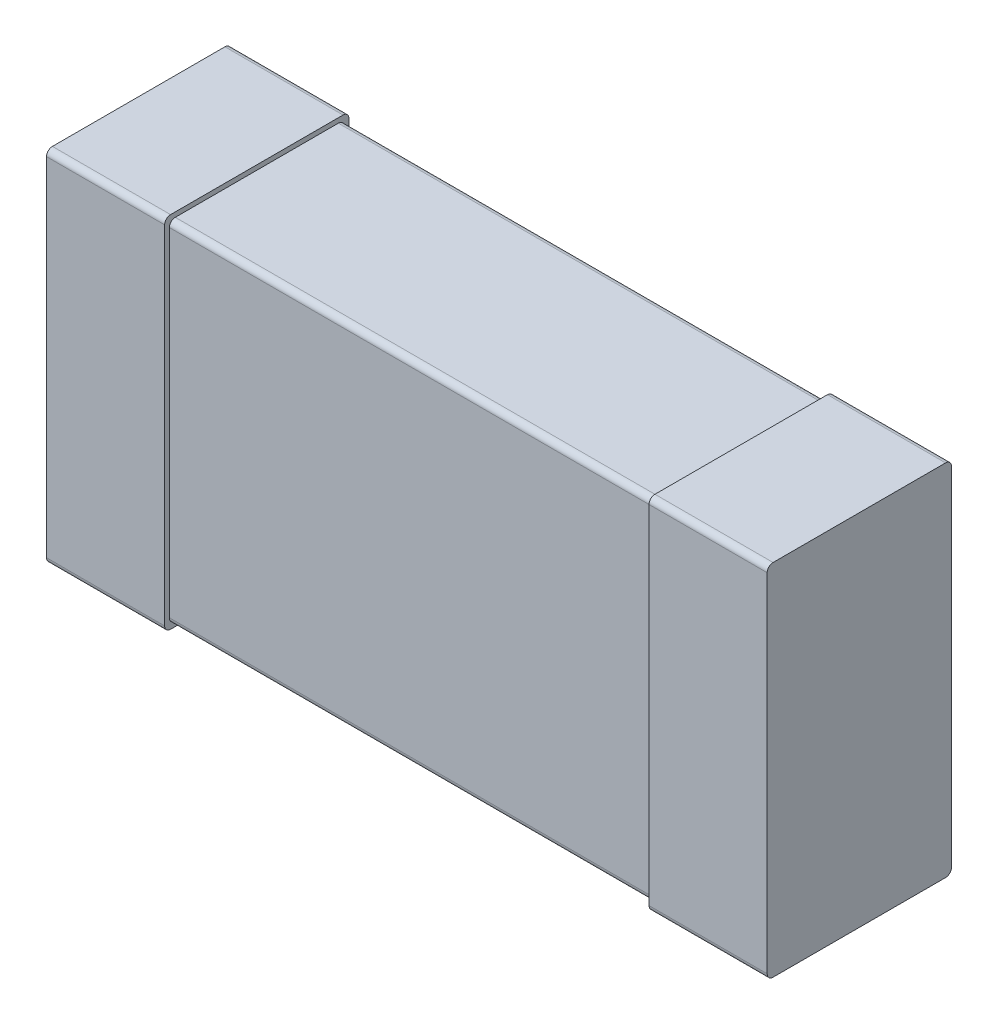
ISO-10303-21;
HEADER;
FILE_DESCRIPTION(('STEP AP214'),'2;1');
FILE_NAME('part.step','',(''),(''),'','','');
FILE_SCHEMA(('AUTOMOTIVE_DESIGN { 1 0 10303 214 1 1 1 1 }'));
ENDSEC;
DATA;
#1=APPLICATION_CONTEXT('core data for automotive mechanical design processes');
#2=APPLICATION_PROTOCOL_DEFINITION('international standard','automotive_design',2000,#1);
#3=PRODUCT_CONTEXT('',#1,'mechanical');
#4=PRODUCT('Part','Part','',(#3));
#5=PRODUCT_RELATED_PRODUCT_CATEGORY('part','',(#4));
#6=PRODUCT_DEFINITION_FORMATION('','',#4);
#7=PRODUCT_DEFINITION_CONTEXT('part definition',#1,'design');
#8=PRODUCT_DEFINITION('design','',#6,#7);
#9=PRODUCT_DEFINITION_SHAPE('','',#8);
#10=(LENGTH_UNIT() NAMED_UNIT(*) SI_UNIT(.MILLI.,.METRE.));
#11=(NAMED_UNIT(*) PLANE_ANGLE_UNIT() SI_UNIT($,.RADIAN.));
#12=(NAMED_UNIT(*) SI_UNIT($,.STERADIAN.) SOLID_ANGLE_UNIT());
#13=UNCERTAINTY_MEASURE_WITH_UNIT(LENGTH_MEASURE(1.E-05),#10,'distance_accuracy_value','');
#14=(GEOMETRIC_REPRESENTATION_CONTEXT(3) GLOBAL_UNCERTAINTY_ASSIGNED_CONTEXT((#13)) GLOBAL_UNIT_ASSIGNED_CONTEXT((#10,
#11,#12)) REPRESENTATION_CONTEXT('',''));
#15=CARTESIAN_POINT('',(0.,0.,0.));
#16=DIRECTION('',(0.,0.,1.));
#17=DIRECTION('',(1.,0.,0.));
#18=AXIS2_PLACEMENT_3D('',#15,#16,#17);
#19=CARTESIAN_POINT('',(-1.025,-0.74,0.76));
#20=DIRECTION('',(0.,0.,1.));
#21=DIRECTION('',(1.,0.,0.));
#22=AXIS2_PLACEMENT_3D('',#19,#20,#21);
#23=PLANE('',#22);
#24=DIRECTION('',(0.,1.,0.));
#25=VECTOR('',#24,1.);
#26=CARTESIAN_POINT('',(1.025,-0.74,0.76));
#27=LINE('',#26,#25);
#28=CARTESIAN_POINT('',(1.025,-0.715,0.76));
#29=VERTEX_POINT('',#28);
#30=CARTESIAN_POINT('',(1.025,0.715,0.76));
#31=VERTEX_POINT('',#30);
#32=EDGE_CURVE('E182',#29,#31,#27,.T.);
#33=ORIENTED_EDGE('',*,*,#32,.T.);
#34=DIRECTION('',(1.,0.,0.));
#35=VECTOR('',#34,1.);
#36=CARTESIAN_POINT('',(-1.025,0.715,0.76));
#37=LINE('',#36,#35);
#38=CARTESIAN_POINT('',(-1.025,0.715,0.76));
#39=VERTEX_POINT('',#38);
#40=EDGE_CURVE('E245',#39,#31,#37,.T.);
#41=ORIENTED_EDGE('',*,*,#40,.F.);
#42=DIRECTION('',(0.,1.,0.));
#43=VECTOR('',#42,1.);
#44=CARTESIAN_POINT('',(-1.025,-0.74,0.76));
#45=LINE('',#44,#43);
#46=CARTESIAN_POINT('',(-1.025,-0.715,0.76));
#47=VERTEX_POINT('',#46);
#48=EDGE_CURVE('E250',#39,#47,#45,.F.);
#49=ORIENTED_EDGE('',*,*,#48,.T.);
#50=DIRECTION('',(1.,0.,0.));
#51=VECTOR('',#50,1.);
#52=CARTESIAN_POINT('',(-1.025,-0.715,0.76));
#53=LINE('',#52,#51);
#54=EDGE_CURVE('E252',#29,#47,#53,.F.);
#55=ORIENTED_EDGE('',*,*,#54,.F.);
#56=EDGE_LOOP('',(#33,#41,#49,#55));
#57=FACE_BOUND('',#56,.T.);
#58=ADVANCED_FACE('F16',(#57),#23,.T.);
#59=CARTESIAN_POINT('',(-1.525,-0.76,0.));
#60=DIRECTION('',(1.,0.,0.));
#61=DIRECTION('',(0.,0.,-1.));
#62=AXIS2_PLACEMENT_3D('',#59,#60,#61);
#63=PLANE('',#62);
#64=DIRECTION('',(0.,1.,0.));
#65=VECTOR('',#64,1.);
#66=CARTESIAN_POINT('',(-1.525,-0.76,0.78));
#67=LINE('',#66,#65);
#68=CARTESIAN_POINT('',(-1.525,0.735,0.78));
#69=VERTEX_POINT('',#68);
#70=CARTESIAN_POINT('',(-1.525,-0.735,0.78));
#71=VERTEX_POINT('',#70);
#72=EDGE_CURVE('E201',#69,#71,#67,.F.);
#73=ORIENTED_EDGE('',*,*,#72,.F.);
#74=CARTESIAN_POINT('',(-1.525,0.735,0.755));
#75=DIRECTION('',(1.,0.,0.));
#76=DIRECTION('',(0.,0.,-1.));
#77=AXIS2_PLACEMENT_3D('',#74,#75,#76);
#78=CIRCLE('',#77,0.025);
#79=CARTESIAN_POINT('',(-1.525,0.76,0.755));
#80=VERTEX_POINT('',#79);
#81=EDGE_CURVE('E210',#80,#69,#78,.T.);
#82=ORIENTED_EDGE('',*,*,#81,.F.);
#83=DIRECTION('',(0.,0.,1.));
#84=VECTOR('',#83,1.);
#85=CARTESIAN_POINT('',(-1.525,0.76,0.));
#86=LINE('',#85,#84);
#87=CARTESIAN_POINT('',(-1.525,0.76,0.025));
#88=VERTEX_POINT('',#87);
#89=EDGE_CURVE('E214',#88,#80,#86,.T.);
#90=ORIENTED_EDGE('',*,*,#89,.F.);
#91=CARTESIAN_POINT('',(-1.525,0.735,0.025));
#92=DIRECTION('',(1.,0.,0.));
#93=DIRECTION('',(0.,0.,-1.));
#94=AXIS2_PLACEMENT_3D('',#91,#92,#93);
#95=CIRCLE('',#94,0.025);
#96=CARTESIAN_POINT('',(-1.525,0.735,0.));
#97=VERTEX_POINT('',#96);
#98=EDGE_CURVE('E215',#97,#88,#95,.T.);
#99=ORIENTED_EDGE('',*,*,#98,.F.);
#100=DIRECTION('',(0.,1.,0.));
#101=VECTOR('',#100,1.);
#102=CARTESIAN_POINT('',(-1.525,-0.76,0.));
#103=LINE('',#102,#101);
#104=CARTESIAN_POINT('',(-1.525,-0.735,0.));
#105=VERTEX_POINT('',#104);
#106=EDGE_CURVE('E222',#97,#105,#103,.F.);
#107=ORIENTED_EDGE('',*,*,#106,.T.);
#108=CARTESIAN_POINT('',(-1.525,-0.735,0.025));
#109=DIRECTION('',(1.,0.,0.));
#110=DIRECTION('',(0.,0.,-1.));
#111=AXIS2_PLACEMENT_3D('',#108,#109,#110);
#112=CIRCLE('',#111,0.025);
#113=CARTESIAN_POINT('',(-1.525,-0.76,0.025));
#114=VERTEX_POINT('',#113);
#115=EDGE_CURVE('E187',#114,#105,#112,.T.);
#116=ORIENTED_EDGE('',*,*,#115,.F.);
#117=DIRECTION('',(0.,0.,1.));
#118=VECTOR('',#117,1.);
#119=CARTESIAN_POINT('',(-1.525,-0.76,0.));
#120=LINE('',#119,#118);
#121=CARTESIAN_POINT('',(-1.525,-0.76,0.755));
#122=VERTEX_POINT('',#121);
#123=EDGE_CURVE('E184',#114,#122,#120,.T.);
#124=ORIENTED_EDGE('',*,*,#123,.T.);
#125=CARTESIAN_POINT('',(-1.525,-0.735,0.755));
#126=DIRECTION('',(1.,0.,0.));
#127=DIRECTION('',(0.,0.,-1.));
#128=AXIS2_PLACEMENT_3D('',#125,#126,#127);
#129=CIRCLE('',#128,0.025);
#130=EDGE_CURVE('E19',#71,#122,#129,.T.);
#131=ORIENTED_EDGE('',*,*,#130,.F.);
#132=EDGE_LOOP('',(#73,#82,#90,#99,#107,#116,#124,#131));
#133=FACE_BOUND('',#132,.T.);
#134=ADVANCED_FACE('F185',(#133),#63,.F.);
#135=CARTESIAN_POINT('',(-1.025,-0.715,0.735));
#136=DIRECTION('',(1.,0.,0.));
#137=DIRECTION('',(0.,0.,-1.));
#138=AXIS2_PLACEMENT_3D('',#135,#136,#137);
#139=CYLINDRICAL_SURFACE('',#138,0.025);
#140=ORIENTED_EDGE('',*,*,#54,.T.);
#141=CARTESIAN_POINT('',(-1.025,-0.715,0.735));
#142=DIRECTION('',(1.,0.,0.));
#143=DIRECTION('',(0.,0.,-1.));
#144=AXIS2_PLACEMENT_3D('',#141,#142,#143);
#145=CIRCLE('',#144,0.025);
#146=CARTESIAN_POINT('',(-1.025,-0.74,0.735));
#147=VERTEX_POINT('',#146);
#148=EDGE_CURVE('E255',#47,#147,#145,.T.);
#149=ORIENTED_EDGE('',*,*,#148,.T.);
#150=DIRECTION('',(1.,0.,0.));
#151=VECTOR('',#150,1.);
#152=CARTESIAN_POINT('',(-1.025,-0.74,0.735));
#153=LINE('',#152,#151);
#154=CARTESIAN_POINT('',(1.025,-0.74,0.735));
#155=VERTEX_POINT('',#154);
#156=EDGE_CURVE('E204',#147,#155,#153,.T.);
#157=ORIENTED_EDGE('',*,*,#156,.T.);
#158=CARTESIAN_POINT('',(1.025,-0.715,0.735));
#159=DIRECTION('',(1.,0.,0.));
#160=DIRECTION('',(0.,0.,-1.));
#161=AXIS2_PLACEMENT_3D('',#158,#159,#160);
#162=CIRCLE('',#161,0.025);
#163=EDGE_CURVE('E181',#155,#29,#162,.F.);
#164=ORIENTED_EDGE('',*,*,#163,.T.);
#165=EDGE_LOOP('',(#140,#149,#157,#164));
#166=FACE_BOUND('',#165,.T.);
#167=ADVANCED_FACE('F314',(#166),#139,.T.);
#168=CARTESIAN_POINT('',(1.525,-0.76,0.));
#169=DIRECTION('',(1.,0.,0.));
#170=DIRECTION('',(0.,0.,-1.));
#171=AXIS2_PLACEMENT_3D('',#168,#169,#170);
#172=PLANE('',#171);
#173=DIRECTION('',(0.,1.,0.));
#174=VECTOR('',#173,1.);
#175=CARTESIAN_POINT('',(1.525,-0.76,0.78));
#176=LINE('',#175,#174);
#177=CARTESIAN_POINT('',(1.525,-0.735,0.78));
#178=VERTEX_POINT('',#177);
#179=CARTESIAN_POINT('',(1.525,0.735,0.78));
#180=VERTEX_POINT('',#179);
#181=EDGE_CURVE('E225',#178,#180,#176,.T.);
#182=ORIENTED_EDGE('',*,*,#181,.F.);
#183=CARTESIAN_POINT('',(1.525,-0.735,0.755));
#184=DIRECTION('',(1.,0.,0.));
#185=DIRECTION('',(0.,0.,-1.));
#186=AXIS2_PLACEMENT_3D('',#183,#184,#185);
#187=CIRCLE('',#186,0.025);
#188=CARTESIAN_POINT('',(1.525,-0.76,0.755));
#189=VERTEX_POINT('',#188);
#190=EDGE_CURVE('E308',#178,#189,#187,.T.);
#191=ORIENTED_EDGE('',*,*,#190,.T.);
#192=DIRECTION('',(0.,0.,1.));
#193=VECTOR('',#192,1.);
#194=CARTESIAN_POINT('',(1.525,-0.76,0.));
#195=LINE('',#194,#193);
#196=CARTESIAN_POINT('',(1.525,-0.76,0.025));
#197=VERTEX_POINT('',#196);
#198=EDGE_CURVE('E229',#189,#197,#195,.F.);
#199=ORIENTED_EDGE('',*,*,#198,.T.);
#200=CARTESIAN_POINT('',(1.525,-0.735,0.025));
#201=DIRECTION('',(1.,0.,0.));
#202=DIRECTION('',(0.,0.,-1.));
#203=AXIS2_PLACEMENT_3D('',#200,#201,#202);
#204=CIRCLE('',#203,0.025);
#205=CARTESIAN_POINT('',(1.525,-0.735,0.));
#206=VERTEX_POINT('',#205);
#207=EDGE_CURVE('E232',#206,#197,#204,.F.);
#208=ORIENTED_EDGE('',*,*,#207,.F.);
#209=DIRECTION('',(0.,1.,0.));
#210=VECTOR('',#209,1.);
#211=CARTESIAN_POINT('',(1.525,-0.76,0.));
#212=LINE('',#211,#210);
#213=CARTESIAN_POINT('',(1.525,0.735,0.));
#214=VERTEX_POINT('',#213);
#215=EDGE_CURVE('E237',#206,#214,#212,.T.);
#216=ORIENTED_EDGE('',*,*,#215,.T.);
#217=CARTESIAN_POINT('',(1.525,0.735,0.025));
#218=DIRECTION('',(1.,0.,0.));
#219=DIRECTION('',(0.,0.,-1.));
#220=AXIS2_PLACEMENT_3D('',#217,#218,#219);
#221=CIRCLE('',#220,0.025);
#222=CARTESIAN_POINT('',(1.525,0.76,0.025));
#223=VERTEX_POINT('',#222);
#224=EDGE_CURVE('E240',#223,#214,#221,.F.);
#225=ORIENTED_EDGE('',*,*,#224,.F.);
#226=DIRECTION('',(0.,0.,1.));
#227=VECTOR('',#226,1.);
#228=CARTESIAN_POINT('',(1.525,0.76,0.));
#229=LINE('',#228,#227);
#230=CARTESIAN_POINT('',(1.525,0.76,0.755));
#231=VERTEX_POINT('',#230);
#232=EDGE_CURVE('E233',#231,#223,#229,.F.);
#233=ORIENTED_EDGE('',*,*,#232,.F.);
#234=CARTESIAN_POINT('',(1.525,0.735,0.755));
#235=DIRECTION('',(1.,0.,0.));
#236=DIRECTION('',(0.,0.,-1.));
#237=AXIS2_PLACEMENT_3D('',#234,#235,#236);
#238=CIRCLE('',#237,0.025);
#239=EDGE_CURVE('E298',#180,#231,#238,.F.);
#240=ORIENTED_EDGE('',*,*,#239,.F.);
#241=EDGE_LOOP('',(#182,#191,#199,#208,#216,#225,#233,#240));
#242=FACE_BOUND('',#241,.T.);
#243=ADVANCED_FACE('F472',(#242),#172,.T.);
#244=CARTESIAN_POINT('',(-1.025,0.715,0.735));
#245=DIRECTION('',(1.,0.,0.));
#246=DIRECTION('',(0.,0.,-1.));
#247=AXIS2_PLACEMENT_3D('',#244,#245,#246);
#248=CYLINDRICAL_SURFACE('',#247,0.025);
#249=CARTESIAN_POINT('',(1.025,0.715,0.735));
#250=DIRECTION('',(1.,0.,0.));
#251=DIRECTION('',(0.,0.,-1.));
#252=AXIS2_PLACEMENT_3D('',#249,#250,#251);
#253=CIRCLE('',#252,0.025);
#254=CARTESIAN_POINT('',(1.025,0.74,0.735));
#255=VERTEX_POINT('',#254);
#256=EDGE_CURVE('E191',#31,#255,#253,.F.);
#257=ORIENTED_EDGE('',*,*,#256,.T.);
#258=DIRECTION('',(1.,0.,0.));
#259=VECTOR('',#258,1.);
#260=CARTESIAN_POINT('',(-1.025,0.74,0.735));
#261=LINE('',#260,#259);
#262=CARTESIAN_POINT('',(-1.025,0.74,0.735));
#263=VERTEX_POINT('',#262);
#264=EDGE_CURVE('E351',#263,#255,#261,.T.);
#265=ORIENTED_EDGE('',*,*,#264,.F.);
#266=CARTESIAN_POINT('',(-1.025,0.715,0.735));
#267=DIRECTION('',(1.,0.,0.));
#268=DIRECTION('',(0.,0.,-1.));
#269=AXIS2_PLACEMENT_3D('',#266,#267,#268);
#270=CIRCLE('',#269,0.025);
#271=EDGE_CURVE('E248',#263,#39,#270,.T.);
#272=ORIENTED_EDGE('',*,*,#271,.T.);
#273=ORIENTED_EDGE('',*,*,#40,.T.);
#274=EDGE_LOOP('',(#257,#265,#272,#273));
#275=FACE_BOUND('',#274,.T.);
#276=ADVANCED_FACE('F469',(#275),#248,.T.);
#277=CARTESIAN_POINT('',(-1.525,-0.76,0.));
#278=DIRECTION('',(0.,1.,0.));
#279=DIRECTION('',(0.,0.,1.));
#280=AXIS2_PLACEMENT_3D('',#277,#278,#279);
#281=PLANE('',#280);
#282=ORIENTED_EDGE('',*,*,#123,.F.);
#283=DIRECTION('',(1.,0.,0.));
#284=VECTOR('',#283,1.);
#285=CARTESIAN_POINT('',(-1.525,-0.76,0.025));
#286=LINE('',#285,#284);
#287=CARTESIAN_POINT('',(-1.025,-0.76,0.025));
#288=VERTEX_POINT('',#287);
#289=EDGE_CURVE('E223',#288,#114,#286,.F.);
#290=ORIENTED_EDGE('',*,*,#289,.F.);
#291=DIRECTION('',(0.,0.,-1.));
#292=VECTOR('',#291,1.);
#293=CARTESIAN_POINT('',(-1.025,-0.76,0.));
#294=LINE('',#293,#292);
#295=CARTESIAN_POINT('',(-1.025,-0.76,0.755));
#296=VERTEX_POINT('',#295);
#297=EDGE_CURVE('E195',#296,#288,#294,.T.);
#298=ORIENTED_EDGE('',*,*,#297,.F.);
#299=DIRECTION('',(1.,0.,0.));
#300=VECTOR('',#299,1.);
#301=CARTESIAN_POINT('',(-1.525,-0.76,0.755));
#302=LINE('',#301,#300);
#303=EDGE_CURVE('E177',#122,#296,#302,.T.);
#304=ORIENTED_EDGE('',*,*,#303,.F.);
#305=EDGE_LOOP('',(#282,#290,#298,#304));
#306=FACE_BOUND('',#305,.T.);
#307=ADVANCED_FACE('F194',(#306),#281,.F.);
#308=CARTESIAN_POINT('',(-1.525,-0.735,0.025));
#309=DIRECTION('',(1.,0.,0.));
#310=DIRECTION('',(0.,0.,-1.));
#311=AXIS2_PLACEMENT_3D('',#308,#309,#310);
#312=CYLINDRICAL_SURFACE('',#311,0.025);
#313=CARTESIAN_POINT('',(-1.025,-0.735,0.025));
#314=DIRECTION('',(1.,0.,0.));
#315=DIRECTION('',(0.,0.,-1.));
#316=AXIS2_PLACEMENT_3D('',#313,#314,#315);
#317=CIRCLE('',#316,0.025);
#318=CARTESIAN_POINT('',(-1.025,-0.735,0.));
#319=VERTEX_POINT('',#318);
#320=EDGE_CURVE('E296',#288,#319,#317,.T.);
#321=ORIENTED_EDGE('',*,*,#320,.F.);
#322=ORIENTED_EDGE('',*,*,#289,.T.);
#323=ORIENTED_EDGE('',*,*,#115,.T.);
#324=DIRECTION('',(1.,0.,0.));
#325=VECTOR('',#324,1.);
#326=CARTESIAN_POINT('',(-1.525,-0.735,0.));
#327=LINE('',#326,#325);
#328=EDGE_CURVE('E219',#105,#319,#327,.T.);
#329=ORIENTED_EDGE('',*,*,#328,.T.);
#330=EDGE_LOOP('',(#321,#322,#323,#329));
#331=FACE_BOUND('',#330,.T.);
#332=ADVANCED_FACE('F462',(#331),#312,.T.);
#333=CARTESIAN_POINT('',(-1.525,-0.76,0.));
#334=DIRECTION('',(0.,0.,1.));
#335=DIRECTION('',(1.,0.,0.));
#336=AXIS2_PLACEMENT_3D('',#333,#334,#335);
#337=PLANE('',#336);
#338=DIRECTION('',(0.,1.,0.));
#339=VECTOR('',#338,1.);
#340=CARTESIAN_POINT('',(-1.025,-0.76,0.));
#341=LINE('',#340,#339);
#342=CARTESIAN_POINT('',(-1.025,0.735,0.));
#343=VERTEX_POINT('',#342);
#344=EDGE_CURVE('E295',#319,#343,#341,.T.);
#345=ORIENTED_EDGE('',*,*,#344,.F.);
#346=ORIENTED_EDGE('',*,*,#328,.F.);
#347=ORIENTED_EDGE('',*,*,#106,.F.);
#348=DIRECTION('',(1.,0.,0.));
#349=VECTOR('',#348,1.);
#350=CARTESIAN_POINT('',(-1.525,0.735,0.));
#351=LINE('',#350,#349);
#352=EDGE_CURVE('E216',#343,#97,#351,.F.);
#353=ORIENTED_EDGE('',*,*,#352,.F.);
#354=EDGE_LOOP('',(#345,#346,#347,#353));
#355=FACE_BOUND('',#354,.T.);
#356=ADVANCED_FACE('F458',(#355),#337,.F.);
#357=CARTESIAN_POINT('',(-1.525,0.735,0.025));
#358=DIRECTION('',(1.,0.,0.));
#359=DIRECTION('',(0.,0.,-1.));
#360=AXIS2_PLACEMENT_3D('',#357,#358,#359);
#361=CYLINDRICAL_SURFACE('',#360,0.025);
#362=ORIENTED_EDGE('',*,*,#352,.T.);
#363=ORIENTED_EDGE('',*,*,#98,.T.);
#364=DIRECTION('',(1.,0.,0.));
#365=VECTOR('',#364,1.);
#366=CARTESIAN_POINT('',(-1.525,0.76,0.025));
#367=LINE('',#366,#365);
#368=CARTESIAN_POINT('',(-1.025,0.76,0.025));
#369=VERTEX_POINT('',#368);
#370=EDGE_CURVE('E211',#369,#88,#367,.F.);
#371=ORIENTED_EDGE('',*,*,#370,.F.);
#372=CARTESIAN_POINT('',(-1.025,0.735,0.025));
#373=DIRECTION('',(1.,0.,0.));
#374=DIRECTION('',(0.,0.,-1.));
#375=AXIS2_PLACEMENT_3D('',#372,#373,#374);
#376=CIRCLE('',#375,0.025);
#377=EDGE_CURVE('E293',#343,#369,#376,.T.);
#378=ORIENTED_EDGE('',*,*,#377,.F.);
#379=EDGE_LOOP('',(#362,#363,#371,#378));
#380=FACE_BOUND('',#379,.T.);
#381=ADVANCED_FACE('F454',(#380),#361,.T.);
#382=CARTESIAN_POINT('',(-1.525,0.76,0.));
#383=DIRECTION('',(0.,1.,0.));
#384=DIRECTION('',(0.,0.,1.));
#385=AXIS2_PLACEMENT_3D('',#382,#383,#384);
#386=PLANE('',#385);
#387=ORIENTED_EDGE('',*,*,#89,.T.);
#388=DIRECTION('',(1.,0.,0.));
#389=VECTOR('',#388,1.);
#390=CARTESIAN_POINT('',(-1.525,0.76,0.755));
#391=LINE('',#390,#389);
#392=CARTESIAN_POINT('',(-1.025,0.76,0.755));
#393=VERTEX_POINT('',#392);
#394=EDGE_CURVE('E207',#393,#80,#391,.F.);
#395=ORIENTED_EDGE('',*,*,#394,.F.);
#396=DIRECTION('',(0.,0.,-1.));
#397=VECTOR('',#396,1.);
#398=CARTESIAN_POINT('',(-1.025,0.76,0.));
#399=LINE('',#398,#397);
#400=EDGE_CURVE('E292',#369,#393,#399,.F.);
#401=ORIENTED_EDGE('',*,*,#400,.F.);
#402=ORIENTED_EDGE('',*,*,#370,.T.);
#403=EDGE_LOOP('',(#387,#395,#401,#402));
#404=FACE_BOUND('',#403,.T.);
#405=ADVANCED_FACE('F450',(#404),#386,.T.);
#406=CARTESIAN_POINT('',(-1.525,0.735,0.755));
#407=DIRECTION('',(1.,0.,0.));
#408=DIRECTION('',(0.,0.,-1.));
#409=AXIS2_PLACEMENT_3D('',#406,#407,#408);
#410=CYLINDRICAL_SURFACE('',#409,0.025);
#411=CARTESIAN_POINT('',(-1.025,0.735,0.755));
#412=DIRECTION('',(1.,0.,0.));
#413=DIRECTION('',(0.,0.,-1.));
#414=AXIS2_PLACEMENT_3D('',#411,#412,#413);
#415=CIRCLE('',#414,0.025);
#416=CARTESIAN_POINT('',(-1.025,0.735,0.78));
#417=VERTEX_POINT('',#416);
#418=EDGE_CURVE('E290',#393,#417,#415,.T.);
#419=ORIENTED_EDGE('',*,*,#418,.F.);
#420=ORIENTED_EDGE('',*,*,#394,.T.);
#421=ORIENTED_EDGE('',*,*,#81,.T.);
#422=DIRECTION('',(1.,0.,0.));
#423=VECTOR('',#422,1.);
#424=CARTESIAN_POINT('',(-1.525,0.735,0.78));
#425=LINE('',#424,#423);
#426=EDGE_CURVE('E196',#417,#69,#425,.F.);
#427=ORIENTED_EDGE('',*,*,#426,.F.);
#428=EDGE_LOOP('',(#419,#420,#421,#427));
#429=FACE_BOUND('',#428,.T.);
#430=ADVANCED_FACE('F446',(#429),#410,.T.);
#431=CARTESIAN_POINT('',(-1.525,-0.76,0.78));
#432=DIRECTION('',(0.,0.,1.));
#433=DIRECTION('',(1.,0.,0.));
#434=AXIS2_PLACEMENT_3D('',#431,#432,#433);
#435=PLANE('',#434);
#436=DIRECTION('',(0.,1.,0.));
#437=VECTOR('',#436,1.);
#438=CARTESIAN_POINT('',(-1.025,-0.76,0.78));
#439=LINE('',#438,#437);
#440=CARTESIAN_POINT('',(-1.025,-0.735,0.78));
#441=VERTEX_POINT('',#440);
#442=EDGE_CURVE('E289',#417,#441,#439,.F.);
#443=ORIENTED_EDGE('',*,*,#442,.F.);
#444=ORIENTED_EDGE('',*,*,#426,.T.);
#445=ORIENTED_EDGE('',*,*,#72,.T.);
#446=DIRECTION('',(1.,0.,0.));
#447=VECTOR('',#446,1.);
#448=CARTESIAN_POINT('',(-1.525,-0.735,0.78));
#449=LINE('',#448,#447);
#450=EDGE_CURVE('E180',#441,#71,#449,.F.);
#451=ORIENTED_EDGE('',*,*,#450,.F.);
#452=EDGE_LOOP('',(#443,#444,#445,#451));
#453=FACE_BOUND('',#452,.T.);
#454=ADVANCED_FACE('F443',(#453),#435,.T.);
#455=CARTESIAN_POINT('',(-1.525,-0.735,0.755));
#456=DIRECTION('',(1.,0.,0.));
#457=DIRECTION('',(0.,0.,-1.));
#458=AXIS2_PLACEMENT_3D('',#455,#456,#457);
#459=CYLINDRICAL_SURFACE('',#458,0.025);
#460=ORIENTED_EDGE('',*,*,#450,.T.);
#461=ORIENTED_EDGE('',*,*,#130,.T.);
#462=ORIENTED_EDGE('',*,*,#303,.T.);
#463=CARTESIAN_POINT('',(-1.025,-0.735,0.755));
#464=DIRECTION('',(1.,0.,0.));
#465=DIRECTION('',(0.,0.,-1.));
#466=AXIS2_PLACEMENT_3D('',#463,#464,#465);
#467=CIRCLE('',#466,0.025);
#468=EDGE_CURVE('E286',#441,#296,#467,.T.);
#469=ORIENTED_EDGE('',*,*,#468,.F.);
#470=EDGE_LOOP('',(#460,#461,#462,#469));
#471=FACE_BOUND('',#470,.T.);
#472=ADVANCED_FACE('F174',(#471),#459,.T.);
#473=CARTESIAN_POINT('',(-1.025,-0.74,0.02));
#474=DIRECTION('',(0.,1.,0.));
#475=DIRECTION('',(0.,0.,1.));
#476=AXIS2_PLACEMENT_3D('',#473,#474,#475);
#477=PLANE('',#476);
#478=DIRECTION('',(0.,0.,-1.));
#479=VECTOR('',#478,1.);
#480=CARTESIAN_POINT('',(-1.025,-0.74,0.));
#481=LINE('',#480,#479);
#482=CARTESIAN_POINT('',(-1.025,-0.74,0.045));
#483=VERTEX_POINT('',#482);
#484=EDGE_CURVE('E288',#483,#147,#481,.F.);
#485=ORIENTED_EDGE('',*,*,#484,.F.);
#486=DIRECTION('',(1.,0.,0.));
#487=VECTOR('',#486,1.);
#488=CARTESIAN_POINT('',(-1.025,-0.74,0.045));
#489=LINE('',#488,#487);
#490=CARTESIAN_POINT('',(1.025,-0.74,0.045));
#491=VERTEX_POINT('',#490);
#492=EDGE_CURVE('E284',#491,#483,#489,.F.);
#493=ORIENTED_EDGE('',*,*,#492,.F.);
#494=DIRECTION('',(0.,0.,1.));
#495=VECTOR('',#494,1.);
#496=CARTESIAN_POINT('',(1.025,-0.74,0.02));
#497=LINE('',#496,#495);
#498=EDGE_CURVE('E198',#155,#491,#497,.F.);
#499=ORIENTED_EDGE('',*,*,#498,.F.);
#500=ORIENTED_EDGE('',*,*,#156,.F.);
#501=EDGE_LOOP('',(#485,#493,#499,#500));
#502=FACE_BOUND('',#501,.T.);
#503=ADVANCED_FACE('F335',(#502),#477,.F.);
#504=CARTESIAN_POINT('',(1.025,-0.76,0.));
#505=DIRECTION('',(0.,1.,0.));
#506=DIRECTION('',(0.,0.,1.));
#507=AXIS2_PLACEMENT_3D('',#504,#505,#506);
#508=PLANE('',#507);
#509=DIRECTION('',(0.,0.,-1.));
#510=VECTOR('',#509,1.);
#511=CARTESIAN_POINT('',(1.025,-0.76,0.));
#512=LINE('',#511,#510);
#513=CARTESIAN_POINT('',(1.025,-0.76,0.755));
#514=VERTEX_POINT('',#513);
#515=CARTESIAN_POINT('',(1.025,-0.76,0.025));
#516=VERTEX_POINT('',#515);
#517=EDGE_CURVE('E281',#514,#516,#512,.T.);
#518=ORIENTED_EDGE('',*,*,#517,.T.);
#519=DIRECTION('',(1.,0.,0.));
#520=VECTOR('',#519,1.);
#521=CARTESIAN_POINT('',(1.025,-0.76,0.025));
#522=LINE('',#521,#520);
#523=EDGE_CURVE('E302',#197,#516,#522,.F.);
#524=ORIENTED_EDGE('',*,*,#523,.F.);
#525=ORIENTED_EDGE('',*,*,#198,.F.);
#526=DIRECTION('',(1.,0.,0.));
#527=VECTOR('',#526,1.);
#528=CARTESIAN_POINT('',(1.025,-0.76,0.755));
#529=LINE('',#528,#527);
#530=EDGE_CURVE('E346',#514,#189,#529,.T.);
#531=ORIENTED_EDGE('',*,*,#530,.F.);
#532=EDGE_LOOP('',(#518,#524,#525,#531));
#533=FACE_BOUND('',#532,.T.);
#534=ADVANCED_FACE('F434',(#533),#508,.F.);
#535=CARTESIAN_POINT('',(1.025,-0.735,0.025));
#536=DIRECTION('',(1.,0.,0.));
#537=DIRECTION('',(0.,0.,-1.));
#538=AXIS2_PLACEMENT_3D('',#535,#536,#537);
#539=CYLINDRICAL_SURFACE('',#538,0.025);
#540=ORIENTED_EDGE('',*,*,#207,.T.);
#541=ORIENTED_EDGE('',*,*,#523,.T.);
#542=CARTESIAN_POINT('',(1.025,-0.735,0.025));
#543=DIRECTION('',(1.,0.,0.));
#544=DIRECTION('',(0.,0.,-1.));
#545=AXIS2_PLACEMENT_3D('',#542,#543,#544);
#546=CIRCLE('',#545,0.025);
#547=CARTESIAN_POINT('',(1.025,-0.735,0.));
#548=VERTEX_POINT('',#547);
#549=EDGE_CURVE('E278',#516,#548,#546,.T.);
#550=ORIENTED_EDGE('',*,*,#549,.T.);
#551=DIRECTION('',(1.,0.,0.));
#552=VECTOR('',#551,1.);
#553=CARTESIAN_POINT('',(1.025,-0.735,0.));
#554=LINE('',#553,#552);
#555=EDGE_CURVE('E241',#548,#206,#554,.T.);
#556=ORIENTED_EDGE('',*,*,#555,.T.);
#557=EDGE_LOOP('',(#540,#541,#550,#556));
#558=FACE_BOUND('',#557,.T.);
#559=ADVANCED_FACE('F430',(#558),#539,.T.);
#560=CARTESIAN_POINT('',(1.025,-0.76,0.));
#561=DIRECTION('',(0.,0.,1.));
#562=DIRECTION('',(1.,0.,0.));
#563=AXIS2_PLACEMENT_3D('',#560,#561,#562);
#564=PLANE('',#563);
#565=ORIENTED_EDGE('',*,*,#215,.F.);
#566=ORIENTED_EDGE('',*,*,#555,.F.);
#567=DIRECTION('',(0.,1.,0.));
#568=VECTOR('',#567,1.);
#569=CARTESIAN_POINT('',(1.025,-0.76,0.));
#570=LINE('',#569,#568);
#571=CARTESIAN_POINT('',(1.025,0.735,0.));
#572=VERTEX_POINT('',#571);
#573=EDGE_CURVE('E277',#548,#572,#570,.T.);
#574=ORIENTED_EDGE('',*,*,#573,.T.);
#575=DIRECTION('',(1.,0.,0.));
#576=VECTOR('',#575,1.);
#577=CARTESIAN_POINT('',(1.025,0.735,0.));
#578=LINE('',#577,#576);
#579=EDGE_CURVE('E236',#214,#572,#578,.F.);
#580=ORIENTED_EDGE('',*,*,#579,.F.);
#581=EDGE_LOOP('',(#565,#566,#574,#580));
#582=FACE_BOUND('',#581,.T.);
#583=ADVANCED_FACE('F426',(#582),#564,.F.);
#584=CARTESIAN_POINT('',(1.025,0.735,0.025));
#585=DIRECTION('',(1.,0.,0.));
#586=DIRECTION('',(0.,0.,-1.));
#587=AXIS2_PLACEMENT_3D('',#584,#585,#586);
#588=CYLINDRICAL_SURFACE('',#587,0.025);
#589=ORIENTED_EDGE('',*,*,#579,.T.);
#590=CARTESIAN_POINT('',(1.025,0.735,0.025));
#591=DIRECTION('',(1.,0.,0.));
#592=DIRECTION('',(0.,0.,-1.));
#593=AXIS2_PLACEMENT_3D('',#590,#591,#592);
#594=CIRCLE('',#593,0.025);
#595=CARTESIAN_POINT('',(1.025,0.76,0.025));
#596=VERTEX_POINT('',#595);
#597=EDGE_CURVE('E274',#572,#596,#594,.T.);
#598=ORIENTED_EDGE('',*,*,#597,.T.);
#599=DIRECTION('',(1.,0.,0.));
#600=VECTOR('',#599,1.);
#601=CARTESIAN_POINT('',(1.025,0.76,0.025));
#602=LINE('',#601,#600);
#603=EDGE_CURVE('E235',#223,#596,#602,.F.);
#604=ORIENTED_EDGE('',*,*,#603,.F.);
#605=ORIENTED_EDGE('',*,*,#224,.T.);
#606=EDGE_LOOP('',(#589,#598,#604,#605));
#607=FACE_BOUND('',#606,.T.);
#608=ADVANCED_FACE('F422',(#607),#588,.T.);
#609=CARTESIAN_POINT('',(1.025,0.76,0.));
#610=DIRECTION('',(0.,1.,0.));
#611=DIRECTION('',(0.,0.,1.));
#612=AXIS2_PLACEMENT_3D('',#609,#610,#611);
#613=PLANE('',#612);
#614=DIRECTION('',(0.,0.,-1.));
#615=VECTOR('',#614,1.);
#616=CARTESIAN_POINT('',(1.025,0.76,0.));
#617=LINE('',#616,#615);
#618=CARTESIAN_POINT('',(1.025,0.76,0.755));
#619=VERTEX_POINT('',#618);
#620=EDGE_CURVE('E273',#596,#619,#617,.F.);
#621=ORIENTED_EDGE('',*,*,#620,.T.);
#622=DIRECTION('',(1.,0.,0.));
#623=VECTOR('',#622,1.);
#624=CARTESIAN_POINT('',(1.025,0.76,0.755));
#625=LINE('',#624,#623);
#626=EDGE_CURVE('E228',#231,#619,#625,.F.);
#627=ORIENTED_EDGE('',*,*,#626,.F.);
#628=ORIENTED_EDGE('',*,*,#232,.T.);
#629=ORIENTED_EDGE('',*,*,#603,.T.);
#630=EDGE_LOOP('',(#621,#627,#628,#629));
#631=FACE_BOUND('',#630,.T.);
#632=ADVANCED_FACE('F418',(#631),#613,.T.);
#633=CARTESIAN_POINT('',(1.025,0.735,0.755));
#634=DIRECTION('',(1.,0.,0.));
#635=DIRECTION('',(0.,0.,-1.));
#636=AXIS2_PLACEMENT_3D('',#633,#634,#635);
#637=CYLINDRICAL_SURFACE('',#636,0.025);
#638=ORIENTED_EDGE('',*,*,#239,.T.);
#639=ORIENTED_EDGE('',*,*,#626,.T.);
#640=CARTESIAN_POINT('',(1.025,0.735,0.755));
#641=DIRECTION('',(1.,0.,0.));
#642=DIRECTION('',(0.,0.,-1.));
#643=AXIS2_PLACEMENT_3D('',#640,#641,#642);
#644=CIRCLE('',#643,0.025);
#645=CARTESIAN_POINT('',(1.025,0.735,0.78));
#646=VERTEX_POINT('',#645);
#647=EDGE_CURVE('E270',#619,#646,#644,.T.);
#648=ORIENTED_EDGE('',*,*,#647,.T.);
#649=DIRECTION('',(1.,0.,0.));
#650=VECTOR('',#649,1.);
#651=CARTESIAN_POINT('',(1.025,0.735,0.78));
#652=LINE('',#651,#650);
#653=EDGE_CURVE('E227',#180,#646,#652,.F.);
#654=ORIENTED_EDGE('',*,*,#653,.F.);
#655=EDGE_LOOP('',(#638,#639,#648,#654));
#656=FACE_BOUND('',#655,.T.);
#657=ADVANCED_FACE('F414',(#656),#637,.T.);
#658=CARTESIAN_POINT('',(1.025,-0.76,0.78));
#659=DIRECTION('',(0.,0.,1.));
#660=DIRECTION('',(1.,0.,0.));
#661=AXIS2_PLACEMENT_3D('',#658,#659,#660);
#662=PLANE('',#661);
#663=ORIENTED_EDGE('',*,*,#181,.T.);
#664=ORIENTED_EDGE('',*,*,#653,.T.);
#665=DIRECTION('',(0.,1.,0.));
#666=VECTOR('',#665,1.);
#667=CARTESIAN_POINT('',(1.025,-0.76,0.78));
#668=LINE('',#667,#666);
#669=CARTESIAN_POINT('',(1.025,-0.735,0.78));
#670=VERTEX_POINT('',#669);
#671=EDGE_CURVE('E269',#646,#670,#668,.F.);
#672=ORIENTED_EDGE('',*,*,#671,.T.);
#673=DIRECTION('',(1.,0.,0.));
#674=VECTOR('',#673,1.);
#675=CARTESIAN_POINT('',(1.025,-0.735,0.78));
#676=LINE('',#675,#674);
#677=EDGE_CURVE('E349',#178,#670,#676,.F.);
#678=ORIENTED_EDGE('',*,*,#677,.F.);
#679=EDGE_LOOP('',(#663,#664,#672,#678));
#680=FACE_BOUND('',#679,.T.);
#681=ADVANCED_FACE('F410',(#680),#662,.T.);
#682=CARTESIAN_POINT('',(1.025,-0.735,0.755));
#683=DIRECTION('',(1.,0.,0.));
#684=DIRECTION('',(0.,0.,-1.));
#685=AXIS2_PLACEMENT_3D('',#682,#683,#684);
#686=CYLINDRICAL_SURFACE('',#685,0.025);
#687=ORIENTED_EDGE('',*,*,#677,.T.);
#688=CARTESIAN_POINT('',(1.025,-0.735,0.755));
#689=DIRECTION('',(1.,0.,0.));
#690=DIRECTION('',(0.,0.,-1.));
#691=AXIS2_PLACEMENT_3D('',#688,#689,#690);
#692=CIRCLE('',#691,0.025);
#693=EDGE_CURVE('E266',#670,#514,#692,.T.);
#694=ORIENTED_EDGE('',*,*,#693,.T.);
#695=ORIENTED_EDGE('',*,*,#530,.T.);
#696=ORIENTED_EDGE('',*,*,#190,.F.);
#697=EDGE_LOOP('',(#687,#694,#695,#696));
#698=FACE_BOUND('',#697,.T.);
#699=ADVANCED_FACE('F407',(#698),#686,.T.);
#700=CARTESIAN_POINT('',(-1.025,0.74,0.02));
#701=DIRECTION('',(0.,1.,0.));
#702=DIRECTION('',(0.,0.,1.));
#703=AXIS2_PLACEMENT_3D('',#700,#701,#702);
#704=PLANE('',#703);
#705=DIRECTION('',(0.,0.,-1.));
#706=VECTOR('',#705,1.);
#707=CARTESIAN_POINT('',(-1.025,0.74,0.));
#708=LINE('',#707,#706);
#709=CARTESIAN_POINT('',(-1.025,0.74,0.045));
#710=VERTEX_POINT('',#709);
#711=EDGE_CURVE('E285',#263,#710,#708,.T.);
#712=ORIENTED_EDGE('',*,*,#711,.F.);
#713=ORIENTED_EDGE('',*,*,#264,.T.);
#714=DIRECTION('',(0.,0.,-1.));
#715=VECTOR('',#714,1.);
#716=CARTESIAN_POINT('',(1.025,0.74,0.));
#717=LINE('',#716,#715);
#718=CARTESIAN_POINT('',(1.025,0.74,0.045));
#719=VERTEX_POINT('',#718);
#720=EDGE_CURVE('E265',#255,#719,#717,.T.);
#721=ORIENTED_EDGE('',*,*,#720,.T.);
#722=DIRECTION('',(1.,0.,0.));
#723=VECTOR('',#722,1.);
#724=CARTESIAN_POINT('',(-1.025,0.74,0.045));
#725=LINE('',#724,#723);
#726=EDGE_CURVE('E261',#710,#719,#725,.T.);
#727=ORIENTED_EDGE('',*,*,#726,.F.);
#728=EDGE_LOOP('',(#712,#713,#721,#727));
#729=FACE_BOUND('',#728,.T.);
#730=ADVANCED_FACE('F381',(#729),#704,.T.);
#731=CARTESIAN_POINT('',(-1.025,-0.76,0.));
#732=DIRECTION('',(1.,0.,0.));
#733=DIRECTION('',(0.,0.,-1.));
#734=AXIS2_PLACEMENT_3D('',#731,#732,#733);
#735=PLANE('',#734);
#736=CARTESIAN_POINT('',(-1.025,0.715,0.045));
#737=DIRECTION('',(1.,0.,0.));
#738=DIRECTION('',(0.,0.,-1.));
#739=AXIS2_PLACEMENT_3D('',#736,#737,#738);
#740=CIRCLE('',#739,0.025);
#741=CARTESIAN_POINT('',(-1.025,0.715,0.02));
#742=VERTEX_POINT('',#741);
#743=EDGE_CURVE('E256',#742,#710,#740,.T.);
#744=ORIENTED_EDGE('',*,*,#743,.F.);
#745=DIRECTION('',(0.,1.,0.));
#746=VECTOR('',#745,1.);
#747=CARTESIAN_POINT('',(-1.025,-0.74,0.02));
#748=LINE('',#747,#746);
#749=CARTESIAN_POINT('',(-1.025,-0.715,0.02));
#750=VERTEX_POINT('',#749);
#751=EDGE_CURVE('E259',#742,#750,#748,.F.);
#752=ORIENTED_EDGE('',*,*,#751,.T.);
#753=CARTESIAN_POINT('',(-1.025,-0.715,0.045));
#754=DIRECTION('',(1.,0.,0.));
#755=DIRECTION('',(0.,0.,-1.));
#756=AXIS2_PLACEMENT_3D('',#753,#754,#755);
#757=CIRCLE('',#756,0.025);
#758=EDGE_CURVE('E282',#483,#750,#757,.T.);
#759=ORIENTED_EDGE('',*,*,#758,.F.);
#760=ORIENTED_EDGE('',*,*,#484,.T.);
#761=ORIENTED_EDGE('',*,*,#148,.F.);
#762=ORIENTED_EDGE('',*,*,#48,.F.);
#763=ORIENTED_EDGE('',*,*,#271,.F.);
#764=ORIENTED_EDGE('',*,*,#711,.T.);
#765=EDGE_LOOP('',(#744,#752,#759,#760,#761,#762,#763,#764));
#766=FACE_BOUND('',#765,.T.);
#767=ORIENTED_EDGE('',*,*,#442,.T.);
#768=ORIENTED_EDGE('',*,*,#468,.T.);
#769=ORIENTED_EDGE('',*,*,#297,.T.);
#770=ORIENTED_EDGE('',*,*,#320,.T.);
#771=ORIENTED_EDGE('',*,*,#344,.T.);
#772=ORIENTED_EDGE('',*,*,#377,.T.);
#773=ORIENTED_EDGE('',*,*,#400,.T.);
#774=ORIENTED_EDGE('',*,*,#418,.T.);
#775=EDGE_LOOP('',(#767,#768,#769,#770,#771,#772,#773,#774));
#776=FACE_BOUND('',#775,.T.);
#777=ADVANCED_FACE('F328',(#766,#776),#735,.T.);
#778=CARTESIAN_POINT('',(-1.025,-0.715,0.045));
#779=DIRECTION('',(1.,0.,0.));
#780=DIRECTION('',(0.,0.,-1.));
#781=AXIS2_PLACEMENT_3D('',#778,#779,#780);
#782=CYLINDRICAL_SURFACE('',#781,0.025);
#783=CARTESIAN_POINT('',(1.025,-0.715,0.045));
#784=DIRECTION('',(1.,0.,0.));
#785=DIRECTION('',(0.,0.,-1.));
#786=AXIS2_PLACEMENT_3D('',#783,#784,#785);
#787=CIRCLE('',#786,0.025);
#788=CARTESIAN_POINT('',(1.025,-0.715,0.02));
#789=VERTEX_POINT('',#788);
#790=EDGE_CURVE('E262',#789,#491,#787,.F.);
#791=ORIENTED_EDGE('',*,*,#790,.T.);
#792=ORIENTED_EDGE('',*,*,#492,.T.);
#793=ORIENTED_EDGE('',*,*,#758,.T.);
#794=DIRECTION('',(1.,0.,0.));
#795=VECTOR('',#794,1.);
#796=CARTESIAN_POINT('',(-1.025,-0.715,0.02));
#797=LINE('',#796,#795);
#798=EDGE_CURVE('E363',#750,#789,#797,.T.);
#799=ORIENTED_EDGE('',*,*,#798,.T.);
#800=EDGE_LOOP('',(#791,#792,#793,#799));
#801=FACE_BOUND('',#800,.T.);
#802=ADVANCED_FACE('F388',(#801),#782,.T.);
#803=CARTESIAN_POINT('',(1.025,-0.76,0.));
#804=DIRECTION('',(1.,0.,0.));
#805=DIRECTION('',(0.,0.,-1.));
#806=AXIS2_PLACEMENT_3D('',#803,#804,#805);
#807=PLANE('',#806);
#808=CARTESIAN_POINT('',(1.025,0.715,0.045));
#809=DIRECTION('',(1.,0.,0.));
#810=DIRECTION('',(0.,0.,-1.));
#811=AXIS2_PLACEMENT_3D('',#808,#809,#810);
#812=CIRCLE('',#811,0.025);
#813=CARTESIAN_POINT('',(1.025,0.715,0.02));
#814=VERTEX_POINT('',#813);
#815=EDGE_CURVE('E33',#719,#814,#812,.F.);
#816=ORIENTED_EDGE('',*,*,#815,.F.);
#817=ORIENTED_EDGE('',*,*,#720,.F.);
#818=ORIENTED_EDGE('',*,*,#256,.F.);
#819=ORIENTED_EDGE('',*,*,#32,.F.);
#820=ORIENTED_EDGE('',*,*,#163,.F.);
#821=ORIENTED_EDGE('',*,*,#498,.T.);
#822=ORIENTED_EDGE('',*,*,#790,.F.);
#823=DIRECTION('',(0.,1.,0.));
#824=VECTOR('',#823,1.);
#825=CARTESIAN_POINT('',(1.025,-0.74,0.02));
#826=LINE('',#825,#824);
#827=EDGE_CURVE('E25',#789,#814,#826,.T.);
#828=ORIENTED_EDGE('',*,*,#827,.T.);
#829=EDGE_LOOP('',(#816,#817,#818,#819,#820,#821,#822,#828));
#830=FACE_BOUND('',#829,.T.);
#831=ORIENTED_EDGE('',*,*,#671,.F.);
#832=ORIENTED_EDGE('',*,*,#647,.F.);
#833=ORIENTED_EDGE('',*,*,#620,.F.);
#834=ORIENTED_EDGE('',*,*,#597,.F.);
#835=ORIENTED_EDGE('',*,*,#573,.F.);
#836=ORIENTED_EDGE('',*,*,#549,.F.);
#837=ORIENTED_EDGE('',*,*,#517,.F.);
#838=ORIENTED_EDGE('',*,*,#693,.F.);
#839=EDGE_LOOP('',(#831,#832,#833,#834,#835,#836,#837,#838));
#840=FACE_BOUND('',#839,.T.);
#841=ADVANCED_FACE('F320',(#830,#840),#807,.F.);
#842=CARTESIAN_POINT('',(-1.025,0.715,0.045));
#843=DIRECTION('',(1.,0.,0.));
#844=DIRECTION('',(0.,0.,-1.));
#845=AXIS2_PLACEMENT_3D('',#842,#843,#844);
#846=CYLINDRICAL_SURFACE('',#845,0.025);
#847=DIRECTION('',(1.,0.,0.));
#848=VECTOR('',#847,1.);
#849=CARTESIAN_POINT('',(-1.025,0.715,0.02));
#850=LINE('',#849,#848);
#851=EDGE_CURVE('E11',#814,#742,#850,.F.);
#852=ORIENTED_EDGE('',*,*,#851,.T.);
#853=ORIENTED_EDGE('',*,*,#743,.T.);
#854=ORIENTED_EDGE('',*,*,#726,.T.);
#855=ORIENTED_EDGE('',*,*,#815,.T.);
#856=EDGE_LOOP('',(#852,#853,#854,#855));
#857=FACE_BOUND('',#856,.T.);
#858=ADVANCED_FACE('F390',(#857),#846,.T.);
#859=CARTESIAN_POINT('',(-1.025,-0.74,0.02));
#860=DIRECTION('',(0.,0.,1.));
#861=DIRECTION('',(1.,0.,0.));
#862=AXIS2_PLACEMENT_3D('',#859,#860,#861);
#863=PLANE('',#862);
#864=ORIENTED_EDGE('',*,*,#827,.F.);
#865=ORIENTED_EDGE('',*,*,#798,.F.);
#866=ORIENTED_EDGE('',*,*,#751,.F.);
#867=ORIENTED_EDGE('',*,*,#851,.F.);
#868=EDGE_LOOP('',(#864,#865,#866,#867));
#869=FACE_BOUND('',#868,.T.);
#870=ADVANCED_FACE('F385',(#869),#863,.F.);
#871=CLOSED_SHELL('',(#58,#134,#167,#243,#276,#307,#332,#356,#381,#405,#430,#454,#472,#503,#534,
#559,#583,#608,#632,#657,#681,#699,#730,#777,#802,#841,#858,#870));
#872=MANIFOLD_SOLID_BREP('B1',#871);
#873=ADVANCED_BREP_SHAPE_REPRESENTATION('',(#18,#872),#14);
#874=SHAPE_DEFINITION_REPRESENTATION(#9,#873);
ENDSEC;
END-ISO-10303-21;
